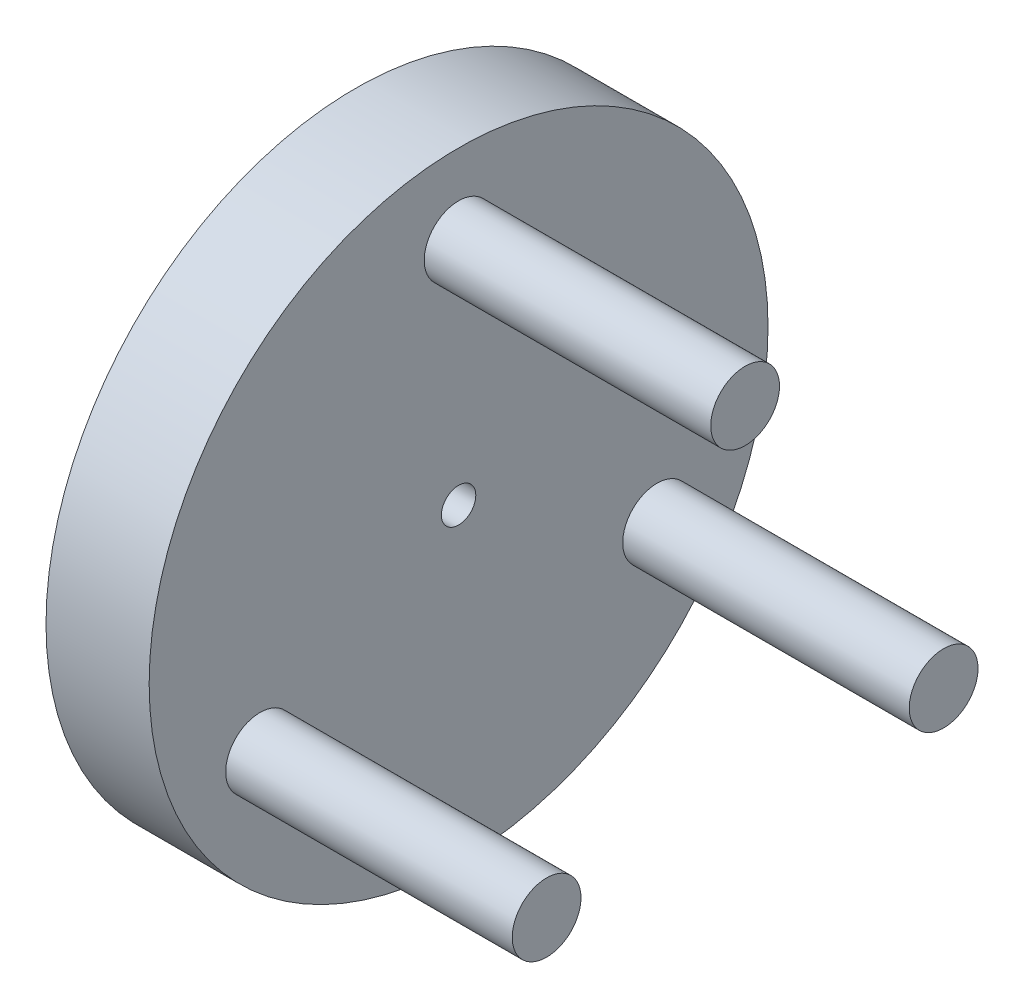
ISO-10303-21;
HEADER;
FILE_DESCRIPTION(('STEP AP214'),'2;1');
FILE_NAME('part.step','',(''),(''),'','','');
FILE_SCHEMA(('AUTOMOTIVE_DESIGN { 1 0 10303 214 1 1 1 1 }'));
ENDSEC;
DATA;
#1=APPLICATION_CONTEXT('core data for automotive mechanical design processes');
#2=APPLICATION_PROTOCOL_DEFINITION('international standard','automotive_design',2000,#1);
#3=PRODUCT_CONTEXT('',#1,'mechanical');
#4=PRODUCT('Part','Part','',(#3));
#5=PRODUCT_RELATED_PRODUCT_CATEGORY('part','',(#4));
#6=PRODUCT_DEFINITION_FORMATION('','',#4);
#7=PRODUCT_DEFINITION_CONTEXT('part definition',#1,'design');
#8=PRODUCT_DEFINITION('design','',#6,#7);
#9=PRODUCT_DEFINITION_SHAPE('','',#8);
#10=(LENGTH_UNIT() NAMED_UNIT(*) SI_UNIT(.MILLI.,.METRE.));
#11=(NAMED_UNIT(*) PLANE_ANGLE_UNIT() SI_UNIT($,.RADIAN.));
#12=(NAMED_UNIT(*) SI_UNIT($,.STERADIAN.) SOLID_ANGLE_UNIT());
#13=UNCERTAINTY_MEASURE_WITH_UNIT(LENGTH_MEASURE(1.E-05),#10,'distance_accuracy_value','');
#14=(GEOMETRIC_REPRESENTATION_CONTEXT(3) GLOBAL_UNCERTAINTY_ASSIGNED_CONTEXT((#13)) GLOBAL_UNIT_ASSIGNED_CONTEXT((#10,
#11,#12)) REPRESENTATION_CONTEXT('',''));
#15=CARTESIAN_POINT('',(0.,0.,0.));
#16=DIRECTION('',(0.,0.,1.));
#17=DIRECTION('',(1.,0.,0.));
#18=AXIS2_PLACEMENT_3D('',#15,#16,#17);
#19=CARTESIAN_POINT('',(4.,0.,0.));
#20=DIRECTION('',(-1.,0.,0.));
#21=DIRECTION('',(0.,0.,1.));
#22=AXIS2_PLACEMENT_3D('',#19,#20,#21);
#23=CYLINDRICAL_SURFACE('',#22,2.8);
#24=CARTESIAN_POINT('',(4.,0.,0.));
#25=DIRECTION('',(1.,0.,0.));
#26=DIRECTION('',(0.,0.,-1.));
#27=AXIS2_PLACEMENT_3D('',#24,#25,#26);
#28=CIRCLE('',#27,2.8);
#29=CARTESIAN_POINT('',(4.,0.,-2.8));
#30=VERTEX_POINT('',#29);
#31=EDGE_CURVE('E63',#30,#30,#28,.T.);
#32=ORIENTED_EDGE('',*,*,#31,.T.);
#33=EDGE_LOOP('',(#32));
#34=FACE_BOUND('',#33,.T.);
#35=CARTESIAN_POINT('',(0.,0.,0.));
#36=DIRECTION('',(1.,0.,0.));
#37=DIRECTION('',(0.,0.,-1.));
#38=AXIS2_PLACEMENT_3D('',#35,#36,#37);
#39=CIRCLE('',#38,2.8);
#40=CARTESIAN_POINT('',(0.,0.,-2.8));
#41=VERTEX_POINT('',#40);
#42=EDGE_CURVE('E58',#41,#41,#39,.T.);
#43=ORIENTED_EDGE('',*,*,#42,.F.);
#44=EDGE_LOOP('',(#43));
#45=FACE_BOUND('',#44,.T.);
#46=ADVANCED_FACE('F51',(#34,#45),#23,.F.);
#47=CARTESIAN_POINT('',(4.,0.,0.));
#48=DIRECTION('',(-1.,0.,0.));
#49=DIRECTION('',(0.,0.,1.));
#50=AXIS2_PLACEMENT_3D('',#47,#48,#49);
#51=CYLINDRICAL_SURFACE('',#50,27.);
#52=CARTESIAN_POINT('',(0.,0.,0.));
#53=DIRECTION('',(1.,0.,0.));
#54=DIRECTION('',(0.,0.,-1.));
#55=AXIS2_PLACEMENT_3D('',#52,#53,#54);
#56=CIRCLE('',#55,27.);
#57=CARTESIAN_POINT('',(0.,0.,-27.));
#58=VERTEX_POINT('',#57);
#59=EDGE_CURVE('E10',#58,#58,#56,.T.);
#60=ORIENTED_EDGE('',*,*,#59,.T.);
#61=EDGE_LOOP('',(#60));
#62=FACE_BOUND('',#61,.T.);
#63=CARTESIAN_POINT('',(9.,0.,0.));
#64=DIRECTION('',(1.,0.,0.));
#65=DIRECTION('',(0.,0.,-1.));
#66=AXIS2_PLACEMENT_3D('',#63,#64,#65);
#67=CIRCLE('',#66,27.);
#68=CARTESIAN_POINT('',(9.,0.,-27.));
#69=VERTEX_POINT('',#68);
#70=EDGE_CURVE('E75',#69,#69,#67,.T.);
#71=ORIENTED_EDGE('',*,*,#70,.F.);
#72=EDGE_LOOP('',(#71));
#73=FACE_BOUND('',#72,.T.);
#74=ADVANCED_FACE('F144',(#62,#73),#51,.T.);
#75=CARTESIAN_POINT('',(0.,0.,0.));
#76=DIRECTION('',(1.,0.,0.));
#77=DIRECTION('',(0.,0.,-1.));
#78=AXIS2_PLACEMENT_3D('',#75,#76,#77);
#79=PLANE('',#78);
#80=ORIENTED_EDGE('',*,*,#42,.T.);
#81=EDGE_LOOP('',(#80));
#82=FACE_BOUND('',#81,.T.);
#83=ORIENTED_EDGE('',*,*,#59,.F.);
#84=EDGE_LOOP('',(#83));
#85=FACE_BOUND('',#84,.T.);
#86=ADVANCED_FACE('F138',(#82,#85),#79,.F.);
#87=CARTESIAN_POINT('',(4.,0.,0.));
#88=DIRECTION('',(1.,0.,0.));
#89=DIRECTION('',(0.,0.,-1.));
#90=AXIS2_PLACEMENT_3D('',#87,#88,#89);
#91=PLANE('',#90);
#92=CARTESIAN_POINT('',(4.,0.,0.));
#93=DIRECTION('',(1.,0.,0.));
#94=DIRECTION('',(0.,0.,-1.));
#95=AXIS2_PLACEMENT_3D('',#92,#93,#94);
#96=CIRCLE('',#95,1.5);
#97=CARTESIAN_POINT('',(4.,0.,-1.5));
#98=VERTEX_POINT('',#97);
#99=EDGE_CURVE('E71',#98,#98,#96,.T.);
#100=ORIENTED_EDGE('',*,*,#99,.T.);
#101=EDGE_LOOP('',(#100));
#102=FACE_BOUND('',#101,.T.);
#103=ORIENTED_EDGE('',*,*,#31,.F.);
#104=EDGE_LOOP('',(#103));
#105=FACE_BOUND('',#104,.T.);
#106=ADVANCED_FACE('F132',(#102,#105),#91,.F.);
#107=CARTESIAN_POINT('',(9.,0.,0.));
#108=DIRECTION('',(-1.,0.,0.));
#109=DIRECTION('',(0.,0.,1.));
#110=AXIS2_PLACEMENT_3D('',#107,#108,#109);
#111=CYLINDRICAL_SURFACE('',#110,1.5);
#112=CARTESIAN_POINT('',(9.,0.,0.));
#113=DIRECTION('',(1.,0.,0.));
#114=DIRECTION('',(0.,0.,-1.));
#115=AXIS2_PLACEMENT_3D('',#112,#113,#114);
#116=CIRCLE('',#115,1.5);
#117=CARTESIAN_POINT('',(9.,0.,-1.5));
#118=VERTEX_POINT('',#117);
#119=EDGE_CURVE('E68',#118,#118,#116,.T.);
#120=ORIENTED_EDGE('',*,*,#119,.T.);
#121=EDGE_LOOP('',(#120));
#122=FACE_BOUND('',#121,.T.);
#123=ORIENTED_EDGE('',*,*,#99,.F.);
#124=EDGE_LOOP('',(#123));
#125=FACE_BOUND('',#124,.T.);
#126=ADVANCED_FACE('F120',(#122,#125),#111,.F.);
#127=CARTESIAN_POINT('',(9.,0.,0.));
#128=DIRECTION('',(1.,0.,0.));
#129=DIRECTION('',(0.,0.,-1.));
#130=AXIS2_PLACEMENT_3D('',#127,#128,#129);
#131=PLANE('',#130);
#132=CARTESIAN_POINT('',(9.,-9.99999999999984,17.3205080756889));
#133=DIRECTION('',(1.,0.,0.));
#134=DIRECTION('',(0.,0.,-1.));
#135=AXIS2_PLACEMENT_3D('',#132,#133,#134);
#136=CIRCLE('',#135,3.);
#137=CARTESIAN_POINT('',(9.,-9.99999999999984,14.3205080756889));
#138=VERTEX_POINT('',#137);
#139=EDGE_CURVE('E99',#138,#138,#136,.T.);
#140=ORIENTED_EDGE('',*,*,#139,.F.);
#141=EDGE_LOOP('',(#140));
#142=FACE_BOUND('',#141,.T.);
#143=CARTESIAN_POINT('',(9.,-10.0000000000009,-17.32050807569));
#144=DIRECTION('',(1.,0.,0.));
#145=DIRECTION('',(0.,0.,-1.));
#146=AXIS2_PLACEMENT_3D('',#143,#144,#145);
#147=CIRCLE('',#146,2.99999999999948);
#148=CARTESIAN_POINT('',(9.,-10.0000000000009,-20.3205080756894));
#149=VERTEX_POINT('',#148);
#150=EDGE_CURVE('E91',#149,#149,#147,.T.);
#151=ORIENTED_EDGE('',*,*,#150,.F.);
#152=EDGE_LOOP('',(#151));
#153=FACE_BOUND('',#152,.T.);
#154=CARTESIAN_POINT('',(9.,20.0000000000007,-1.46428559612947E-12));
#155=DIRECTION('',(1.,0.,0.));
#156=DIRECTION('',(0.,0.,-1.));
#157=AXIS2_PLACEMENT_3D('',#154,#155,#156);
#158=CIRCLE('',#157,2.99999999999839);
#159=CARTESIAN_POINT('',(9.,20.0000000000007,-2.99999999999985));
#160=VERTEX_POINT('',#159);
#161=EDGE_CURVE('E83',#160,#160,#158,.T.);
#162=ORIENTED_EDGE('',*,*,#161,.F.);
#163=EDGE_LOOP('',(#162));
#164=FACE_BOUND('',#163,.T.);
#165=ORIENTED_EDGE('',*,*,#70,.T.);
#166=EDGE_LOOP('',(#165));
#167=FACE_BOUND('',#166,.T.);
#168=ORIENTED_EDGE('',*,*,#119,.F.);
#169=EDGE_LOOP('',(#168));
#170=FACE_BOUND('',#169,.T.);
#171=ADVANCED_FACE('F116',(#142,#153,#164,#167,#170),#131,.T.);
#172=CARTESIAN_POINT('',(34.,20.0000000000007,-1.46428559612947E-12));
#173=DIRECTION('',(-1.,0.,0.));
#174=DIRECTION('',(0.,0.,1.));
#175=AXIS2_PLACEMENT_3D('',#172,#173,#174);
#176=CYLINDRICAL_SURFACE('',#175,2.99999999999839);
#177=CARTESIAN_POINT('',(34.,20.0000000000007,-1.46428559612947E-12));
#178=DIRECTION('',(1.,0.,0.));
#179=DIRECTION('',(0.,0.,-1.));
#180=AXIS2_PLACEMENT_3D('',#177,#178,#179);
#181=CIRCLE('',#180,2.99999999999839);
#182=CARTESIAN_POINT('',(34.,20.0000000000007,-2.99999999999985));
#183=VERTEX_POINT('',#182);
#184=EDGE_CURVE('E76',#183,#183,#181,.T.);
#185=ORIENTED_EDGE('',*,*,#184,.F.);
#186=EDGE_LOOP('',(#185));
#187=FACE_BOUND('',#186,.T.);
#188=ORIENTED_EDGE('',*,*,#161,.T.);
#189=EDGE_LOOP('',(#188));
#190=FACE_BOUND('',#189,.T.);
#191=ADVANCED_FACE('F119',(#187,#190),#176,.T.);
#192=CARTESIAN_POINT('',(34.,20.0000000000007,-1.46428559612947E-12));
#193=DIRECTION('',(1.,0.,0.));
#194=DIRECTION('',(0.,0.,-1.));
#195=AXIS2_PLACEMENT_3D('',#192,#193,#194);
#196=PLANE('',#195);
#197=ORIENTED_EDGE('',*,*,#184,.T.);
#198=EDGE_LOOP('',(#197));
#199=FACE_BOUND('',#198,.T.);
#200=ADVANCED_FACE('F156',(#199),#196,.T.);
#201=CARTESIAN_POINT('',(34.,-10.0000000000009,-17.32050807569));
#202=DIRECTION('',(-1.,0.,0.));
#203=DIRECTION('',(0.,0.,1.));
#204=AXIS2_PLACEMENT_3D('',#201,#202,#203);
#205=CYLINDRICAL_SURFACE('',#204,2.99999999999948);
#206=CARTESIAN_POINT('',(34.,-10.0000000000009,-17.32050807569));
#207=DIRECTION('',(1.,0.,0.));
#208=DIRECTION('',(0.,0.,-1.));
#209=AXIS2_PLACEMENT_3D('',#206,#207,#208);
#210=CIRCLE('',#209,2.99999999999948);
#211=CARTESIAN_POINT('',(34.,-10.0000000000009,-20.3205080756894));
#212=VERTEX_POINT('',#211);
#213=EDGE_CURVE('E87',#212,#212,#210,.T.);
#214=ORIENTED_EDGE('',*,*,#213,.F.);
#215=EDGE_LOOP('',(#214));
#216=FACE_BOUND('',#215,.T.);
#217=ORIENTED_EDGE('',*,*,#150,.T.);
#218=EDGE_LOOP('',(#217));
#219=FACE_BOUND('',#218,.T.);
#220=ADVANCED_FACE('F160',(#216,#219),#205,.T.);
#221=CARTESIAN_POINT('',(34.,-10.0000000000009,-17.32050807569));
#222=DIRECTION('',(1.,0.,0.));
#223=DIRECTION('',(0.,0.,-1.));
#224=AXIS2_PLACEMENT_3D('',#221,#222,#223);
#225=PLANE('',#224);
#226=ORIENTED_EDGE('',*,*,#213,.T.);
#227=EDGE_LOOP('',(#226));
#228=FACE_BOUND('',#227,.T.);
#229=ADVANCED_FACE('F112',(#228),#225,.T.);
#230=CARTESIAN_POINT('',(34.,-9.99999999999984,17.3205080756889));
#231=DIRECTION('',(-1.,0.,0.));
#232=DIRECTION('',(0.,0.,1.));
#233=AXIS2_PLACEMENT_3D('',#230,#231,#232);
#234=CYLINDRICAL_SURFACE('',#233,3.);
#235=CARTESIAN_POINT('',(34.,-9.99999999999984,17.3205080756889));
#236=DIRECTION('',(1.,0.,0.));
#237=DIRECTION('',(0.,0.,-1.));
#238=AXIS2_PLACEMENT_3D('',#235,#236,#237);
#239=CIRCLE('',#238,3.);
#240=CARTESIAN_POINT('',(34.,-9.99999999999984,14.3205080756889));
#241=VERTEX_POINT('',#240);
#242=EDGE_CURVE('E95',#241,#241,#239,.T.);
#243=ORIENTED_EDGE('',*,*,#242,.F.);
#244=EDGE_LOOP('',(#243));
#245=FACE_BOUND('',#244,.T.);
#246=ORIENTED_EDGE('',*,*,#139,.T.);
#247=EDGE_LOOP('',(#246));
#248=FACE_BOUND('',#247,.T.);
#249=ADVANCED_FACE('F109',(#245,#248),#234,.T.);
#250=CARTESIAN_POINT('',(34.,-9.99999999999984,17.3205080756889));
#251=DIRECTION('',(1.,0.,0.));
#252=DIRECTION('',(0.,0.,-1.));
#253=AXIS2_PLACEMENT_3D('',#250,#251,#252);
#254=PLANE('',#253);
#255=ORIENTED_EDGE('',*,*,#242,.T.);
#256=EDGE_LOOP('',(#255));
#257=FACE_BOUND('',#256,.T.);
#258=ADVANCED_FACE('F107',(#257),#254,.T.);
#259=CLOSED_SHELL('',(#46,#74,#86,#106,#126,#171,#191,#200,#220,#229,#249,#258));
#260=MANIFOLD_SOLID_BREP('B2',#259);
#261=ADVANCED_BREP_SHAPE_REPRESENTATION('',(#18,#260),#14);
#262=SHAPE_DEFINITION_REPRESENTATION(#9,#261);
ENDSEC;
END-ISO-10303-21;
